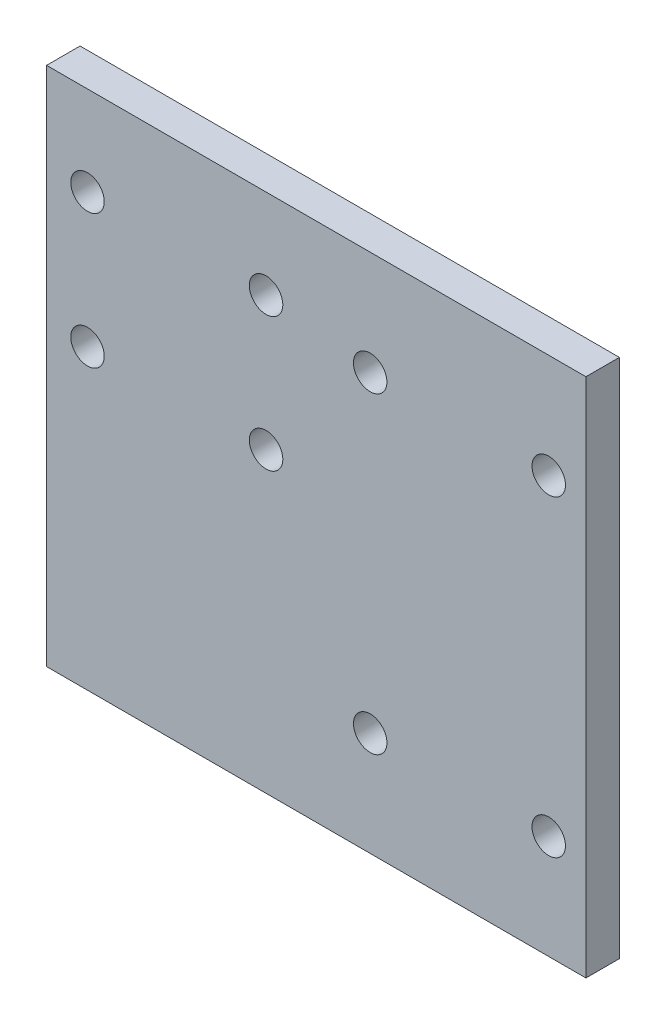
ISO-10303-21;
HEADER;
FILE_DESCRIPTION(('STEP AP214'),'2;1');
FILE_NAME('part.step','',(''),(''),'','','');
FILE_SCHEMA(('AUTOMOTIVE_DESIGN { 1 0 10303 214 1 1 1 1 }'));
ENDSEC;
DATA;
#1=APPLICATION_CONTEXT('core data for automotive mechanical design processes');
#2=APPLICATION_PROTOCOL_DEFINITION('international standard','automotive_design',2000,#1);
#3=PRODUCT_CONTEXT('',#1,'mechanical');
#4=PRODUCT('Part','Part','',(#3));
#5=PRODUCT_RELATED_PRODUCT_CATEGORY('part','',(#4));
#6=PRODUCT_DEFINITION_FORMATION('','',#4);
#7=PRODUCT_DEFINITION_CONTEXT('part definition',#1,'design');
#8=PRODUCT_DEFINITION('design','',#6,#7);
#9=PRODUCT_DEFINITION_SHAPE('','',#8);
#10=(LENGTH_UNIT() NAMED_UNIT(*) SI_UNIT(.MILLI.,.METRE.));
#11=(NAMED_UNIT(*) PLANE_ANGLE_UNIT() SI_UNIT($,.RADIAN.));
#12=(NAMED_UNIT(*) SI_UNIT($,.STERADIAN.) SOLID_ANGLE_UNIT());
#13=UNCERTAINTY_MEASURE_WITH_UNIT(LENGTH_MEASURE(1.E-05),#10,'distance_accuracy_value','');
#14=(GEOMETRIC_REPRESENTATION_CONTEXT(3) GLOBAL_UNCERTAINTY_ASSIGNED_CONTEXT((#13)) GLOBAL_UNIT_ASSIGNED_CONTEXT((#10,
#11,#12)) REPRESENTATION_CONTEXT('',''));
#15=CARTESIAN_POINT('',(0.,0.,0.));
#16=DIRECTION('',(0.,0.,1.));
#17=DIRECTION('',(1.,0.,0.));
#18=AXIS2_PLACEMENT_3D('',#15,#16,#17);
#19=CARTESIAN_POINT('',(-40.2261499577321,36.6168583740955,-4.5));
#20=DIRECTION('',(-1.,0.,0.));
#21=DIRECTION('',(0.,-1.,0.));
#22=AXIS2_PLACEMENT_3D('',#19,#20,#21);
#23=PLANE('',#22);
#24=DIRECTION('',(0.,-1.,0.));
#25=VECTOR('',#24,1.);
#26=CARTESIAN_POINT('',(-40.2261499577321,36.6168583740955,0.));
#27=LINE('',#26,#25);
#28=CARTESIAN_POINT('',(-40.2261499577321,36.6168583740955,0.));
#29=VERTEX_POINT('',#28);
#30=CARTESIAN_POINT('',(-40.2261499577321,-33.3831416259045,0.));
#31=VERTEX_POINT('',#30);
#32=EDGE_CURVE('E104',#29,#31,#27,.T.);
#33=ORIENTED_EDGE('',*,*,#32,.F.);
#34=DIRECTION('',(0.,0.,1.));
#35=VECTOR('',#34,1.);
#36=CARTESIAN_POINT('',(-40.2261499577321,36.6168583740955,-4.5));
#37=LINE('',#36,#35);
#38=CARTESIAN_POINT('',(-40.2261499577321,36.6168583740955,-4.5));
#39=VERTEX_POINT('',#38);
#40=EDGE_CURVE('E11',#39,#29,#37,.T.);
#41=ORIENTED_EDGE('',*,*,#40,.F.);
#42=DIRECTION('',(0.,-1.,0.));
#43=VECTOR('',#42,1.);
#44=CARTESIAN_POINT('',(-40.2261499577321,36.6168583740955,-4.5));
#45=LINE('',#44,#43);
#46=CARTESIAN_POINT('',(-40.2261499577321,-33.3831416259045,-4.5));
#47=VERTEX_POINT('',#46);
#48=EDGE_CURVE('E97',#39,#47,#45,.T.);
#49=ORIENTED_EDGE('',*,*,#48,.T.);
#50=DIRECTION('',(0.,0.,1.));
#51=VECTOR('',#50,1.);
#52=CARTESIAN_POINT('',(-40.2261499577321,-33.3831416259045,-4.5));
#53=LINE('',#52,#51);
#54=EDGE_CURVE('E42',#47,#31,#53,.T.);
#55=ORIENTED_EDGE('',*,*,#54,.T.);
#56=EDGE_LOOP('',(#33,#41,#49,#55));
#57=FACE_BOUND('',#56,.T.);
#58=ADVANCED_FACE('F39',(#57),#23,.T.);
#59=CARTESIAN_POINT('',(-40.2261499577321,36.6168583740955,-4.5));
#60=DIRECTION('',(0.,1.,0.));
#61=DIRECTION('',(0.,0.,1.));
#62=AXIS2_PLACEMENT_3D('',#59,#60,#61);
#63=PLANE('',#62);
#64=DIRECTION('',(-1.,0.,0.));
#65=VECTOR('',#64,1.);
#66=CARTESIAN_POINT('',(-40.2261499577321,36.6168583740955,0.));
#67=LINE('',#66,#65);
#68=CARTESIAN_POINT('',(32.2738500422679,36.6168583740955,0.));
#69=VERTEX_POINT('',#68);
#70=EDGE_CURVE('E99',#69,#29,#67,.T.);
#71=ORIENTED_EDGE('',*,*,#70,.F.);
#72=DIRECTION('',(0.,0.,1.));
#73=VECTOR('',#72,1.);
#74=CARTESIAN_POINT('',(32.2738500422679,36.6168583740955,-4.5));
#75=LINE('',#74,#73);
#76=CARTESIAN_POINT('',(32.2738500422679,36.6168583740955,-4.5));
#77=VERTEX_POINT('',#76);
#78=EDGE_CURVE('E48',#77,#69,#75,.T.);
#79=ORIENTED_EDGE('',*,*,#78,.F.);
#80=DIRECTION('',(-1.,0.,0.));
#81=VECTOR('',#80,1.);
#82=CARTESIAN_POINT('',(-40.2261499577321,36.6168583740955,-4.5));
#83=LINE('',#82,#81);
#84=EDGE_CURVE('E94',#77,#39,#83,.T.);
#85=ORIENTED_EDGE('',*,*,#84,.T.);
#86=ORIENTED_EDGE('',*,*,#40,.T.);
#87=EDGE_LOOP('',(#71,#79,#85,#86));
#88=FACE_BOUND('',#87,.T.);
#89=ADVANCED_FACE('F115',(#88),#63,.T.);
#90=CARTESIAN_POINT('',(32.2738500422679,36.6168583740955,-4.5));
#91=DIRECTION('',(1.,0.,0.));
#92=DIRECTION('',(0.,1.,0.));
#93=AXIS2_PLACEMENT_3D('',#90,#91,#92);
#94=PLANE('',#93);
#95=DIRECTION('',(0.,1.,0.));
#96=VECTOR('',#95,1.);
#97=CARTESIAN_POINT('',(32.2738500422679,36.6168583740955,0.));
#98=LINE('',#97,#96);
#99=CARTESIAN_POINT('',(32.2738500422679,-33.3831416259045,0.));
#100=VERTEX_POINT('',#99);
#101=EDGE_CURVE('E89',#100,#69,#98,.T.);
#102=ORIENTED_EDGE('',*,*,#101,.F.);
#103=DIRECTION('',(0.,0.,1.));
#104=VECTOR('',#103,1.);
#105=CARTESIAN_POINT('',(32.2738500422679,-33.3831416259045,-4.5));
#106=LINE('',#105,#104);
#107=CARTESIAN_POINT('',(32.2738500422679,-33.3831416259045,-4.5));
#108=VERTEX_POINT('',#107);
#109=EDGE_CURVE('E84',#108,#100,#106,.T.);
#110=ORIENTED_EDGE('',*,*,#109,.F.);
#111=DIRECTION('',(0.,1.,0.));
#112=VECTOR('',#111,1.);
#113=CARTESIAN_POINT('',(32.2738500422679,36.6168583740955,-4.5));
#114=LINE('',#113,#112);
#115=EDGE_CURVE('E87',#108,#77,#114,.T.);
#116=ORIENTED_EDGE('',*,*,#115,.T.);
#117=ORIENTED_EDGE('',*,*,#78,.T.);
#118=EDGE_LOOP('',(#102,#110,#116,#117));
#119=FACE_BOUND('',#118,.T.);
#120=ADVANCED_FACE('F86',(#119),#94,.T.);
#121=CARTESIAN_POINT('',(-40.2261499577321,-33.3831416259045,-4.5));
#122=DIRECTION('',(0.,-1.,0.));
#123=DIRECTION('',(0.,0.,-1.));
#124=AXIS2_PLACEMENT_3D('',#121,#122,#123);
#125=PLANE('',#124);
#126=DIRECTION('',(1.,0.,0.));
#127=VECTOR('',#126,1.);
#128=CARTESIAN_POINT('',(-40.2261499577321,-33.3831416259045,0.));
#129=LINE('',#128,#127);
#130=EDGE_CURVE('E107',#31,#100,#129,.T.);
#131=ORIENTED_EDGE('',*,*,#130,.F.);
#132=ORIENTED_EDGE('',*,*,#54,.F.);
#133=DIRECTION('',(1.,0.,0.));
#134=VECTOR('',#133,1.);
#135=CARTESIAN_POINT('',(-40.2261499577321,-33.3831416259045,-4.5));
#136=LINE('',#135,#134);
#137=EDGE_CURVE('E93',#47,#108,#136,.T.);
#138=ORIENTED_EDGE('',*,*,#137,.T.);
#139=ORIENTED_EDGE('',*,*,#109,.T.);
#140=EDGE_LOOP('',(#131,#132,#138,#139));
#141=FACE_BOUND('',#140,.T.);
#142=ADVANCED_FACE('F96',(#141),#125,.T.);
#143=CARTESIAN_POINT('',(0.,0.,-4.5));
#144=DIRECTION('',(0.,0.,1.));
#145=DIRECTION('',(1.,0.,0.));
#146=AXIS2_PLACEMENT_3D('',#143,#144,#145);
#147=PLANE('',#146);
#148=CARTESIAN_POINT('',(27.2738500422703,22.6168583741015,-4.5));
#149=DIRECTION('',(0.,0.,1.));
#150=DIRECTION('',(-1.,0.,0.));
#151=AXIS2_PLACEMENT_3D('',#148,#149,#150);
#152=CIRCLE('',#151,2.25000000000001);
#153=CARTESIAN_POINT('',(25.0238500422703,22.6168583741015,-4.5));
#154=VERTEX_POINT('',#153);
#155=EDGE_CURVE('E172',#154,#154,#152,.T.);
#156=ORIENTED_EDGE('',*,*,#155,.T.);
#157=EDGE_LOOP('',(#156));
#158=FACE_BOUND('',#157,.T.);
#159=CARTESIAN_POINT('',(27.2738500422705,-19.3831416258993,-4.5));
#160=DIRECTION('',(0.,0.,1.));
#161=DIRECTION('',(-1.,0.,0.));
#162=AXIS2_PLACEMENT_3D('',#159,#160,#161);
#163=CIRCLE('',#162,2.25000000000001);
#164=CARTESIAN_POINT('',(25.0238500422705,-19.3831416258993,-4.5));
#165=VERTEX_POINT('',#164);
#166=EDGE_CURVE('E180',#165,#165,#163,.T.);
#167=ORIENTED_EDGE('',*,*,#166,.T.);
#168=EDGE_LOOP('',(#167));
#169=FACE_BOUND('',#168,.T.);
#170=CARTESIAN_POINT('',(3.27385004226982,22.6168583741013,-4.5));
#171=DIRECTION('',(0.,0.,1.));
#172=DIRECTION('',(-1.,0.,0.));
#173=AXIS2_PLACEMENT_3D('',#170,#171,#172);
#174=CIRCLE('',#173,2.25000000000001);
#175=CARTESIAN_POINT('',(1.02385004226982,22.6168583741013,-4.5));
#176=VERTEX_POINT('',#175);
#177=EDGE_CURVE('E186',#176,#176,#174,.T.);
#178=ORIENTED_EDGE('',*,*,#177,.T.);
#179=EDGE_LOOP('',(#178));
#180=FACE_BOUND('',#179,.T.);
#181=CARTESIAN_POINT('',(3.27385004227005,-19.3831416258995,-4.5));
#182=DIRECTION('',(0.,0.,1.));
#183=DIRECTION('',(-1.,0.,0.));
#184=AXIS2_PLACEMENT_3D('',#181,#182,#183);
#185=CIRCLE('',#184,2.25000000000001);
#186=CARTESIAN_POINT('',(1.02385004227004,-19.3831416258995,-4.5));
#187=VERTEX_POINT('',#186);
#188=EDGE_CURVE('E192',#187,#187,#185,.T.);
#189=ORIENTED_EDGE('',*,*,#188,.T.);
#190=EDGE_LOOP('',(#189));
#191=FACE_BOUND('',#190,.T.);
#192=CARTESIAN_POINT('',(-34.7261499576124,6.61685837409152,-4.5));
#193=DIRECTION('',(0.,0.,1.));
#194=DIRECTION('',(-1.,0.,0.));
#195=AXIS2_PLACEMENT_3D('',#192,#193,#194);
#196=CIRCLE('',#195,2.25000000000001);
#197=CARTESIAN_POINT('',(-36.9761499576124,6.61685837409152,-4.5));
#198=VERTEX_POINT('',#197);
#199=EDGE_CURVE('E198',#198,#198,#196,.T.);
#200=ORIENTED_EDGE('',*,*,#199,.T.);
#201=EDGE_LOOP('',(#200));
#202=FACE_BOUND('',#201,.T.);
#203=CARTESIAN_POINT('',(-10.7261499576119,6.61685837409152,-4.5));
#204=DIRECTION('',(0.,0.,1.));
#205=DIRECTION('',(-1.,0.,0.));
#206=AXIS2_PLACEMENT_3D('',#203,#204,#205);
#207=CIRCLE('',#206,2.25000000000001);
#208=CARTESIAN_POINT('',(-12.9761499576119,6.61685837409152,-4.5));
#209=VERTEX_POINT('',#208);
#210=EDGE_CURVE('E204',#209,#209,#207,.T.);
#211=ORIENTED_EDGE('',*,*,#210,.T.);
#212=EDGE_LOOP('',(#211));
#213=FACE_BOUND('',#212,.T.);
#214=CARTESIAN_POINT('',(-10.7261499576262,24.6168583740919,-4.5));
#215=DIRECTION('',(0.,0.,1.));
#216=DIRECTION('',(-1.,0.,0.));
#217=AXIS2_PLACEMENT_3D('',#214,#215,#216);
#218=CIRCLE('',#217,2.25000000000001);
#219=CARTESIAN_POINT('',(-12.9761499576262,24.6168583740919,-4.5));
#220=VERTEX_POINT('',#219);
#221=EDGE_CURVE('E210',#220,#220,#218,.T.);
#222=ORIENTED_EDGE('',*,*,#221,.T.);
#223=EDGE_LOOP('',(#222));
#224=FACE_BOUND('',#223,.T.);
#225=CARTESIAN_POINT('',(-34.7261499576124,24.6168583740919,-4.5));
#226=DIRECTION('',(0.,0.,1.));
#227=DIRECTION('',(-1.,0.,0.));
#228=AXIS2_PLACEMENT_3D('',#225,#226,#227);
#229=CIRCLE('',#228,2.25000000000001);
#230=CARTESIAN_POINT('',(-36.9761499576124,24.6168583740919,-4.5));
#231=VERTEX_POINT('',#230);
#232=EDGE_CURVE('E108',#231,#231,#229,.T.);
#233=ORIENTED_EDGE('',*,*,#232,.T.);
#234=EDGE_LOOP('',(#233));
#235=FACE_BOUND('',#234,.T.);
#236=ORIENTED_EDGE('',*,*,#48,.F.);
#237=ORIENTED_EDGE('',*,*,#84,.F.);
#238=ORIENTED_EDGE('',*,*,#115,.F.);
#239=ORIENTED_EDGE('',*,*,#137,.F.);
#240=EDGE_LOOP('',(#236,#237,#238,#239));
#241=FACE_BOUND('',#240,.T.);
#242=ADVANCED_FACE('F92',(#158,#169,#180,#191,#202,#213,#224,#235,#241),#147,.F.);
#243=CARTESIAN_POINT('',(0.,0.,0.));
#244=DIRECTION('',(0.,0.,1.));
#245=DIRECTION('',(1.,0.,0.));
#246=AXIS2_PLACEMENT_3D('',#243,#244,#245);
#247=PLANE('',#246);
#248=CARTESIAN_POINT('',(27.2738500422703,22.6168583741015,0.));
#249=DIRECTION('',(0.,0.,1.));
#250=DIRECTION('',(-1.,0.,0.));
#251=AXIS2_PLACEMENT_3D('',#248,#249,#250);
#252=CIRCLE('',#251,2.25000000000001);
#253=CARTESIAN_POINT('',(25.0238500422703,22.6168583741015,0.));
#254=VERTEX_POINT('',#253);
#255=EDGE_CURVE('E175',#254,#254,#252,.T.);
#256=ORIENTED_EDGE('',*,*,#255,.F.);
#257=EDGE_LOOP('',(#256));
#258=FACE_BOUND('',#257,.T.);
#259=CARTESIAN_POINT('',(27.2738500422705,-19.3831416258993,0.));
#260=DIRECTION('',(0.,0.,1.));
#261=DIRECTION('',(-1.,0.,0.));
#262=AXIS2_PLACEMENT_3D('',#259,#260,#261);
#263=CIRCLE('',#262,2.25000000000001);
#264=CARTESIAN_POINT('',(25.0238500422705,-19.3831416258993,0.));
#265=VERTEX_POINT('',#264);
#266=EDGE_CURVE('E177',#265,#265,#263,.T.);
#267=ORIENTED_EDGE('',*,*,#266,.F.);
#268=EDGE_LOOP('',(#267));
#269=FACE_BOUND('',#268,.T.);
#270=CARTESIAN_POINT('',(3.27385004226982,22.6168583741013,0.));
#271=DIRECTION('',(0.,0.,1.));
#272=DIRECTION('',(-1.,0.,0.));
#273=AXIS2_PLACEMENT_3D('',#270,#271,#272);
#274=CIRCLE('',#273,2.25000000000001);
#275=CARTESIAN_POINT('',(1.02385004226982,22.6168583741013,0.));
#276=VERTEX_POINT('',#275);
#277=EDGE_CURVE('E183',#276,#276,#274,.T.);
#278=ORIENTED_EDGE('',*,*,#277,.F.);
#279=EDGE_LOOP('',(#278));
#280=FACE_BOUND('',#279,.T.);
#281=CARTESIAN_POINT('',(3.27385004227005,-19.3831416258995,0.));
#282=DIRECTION('',(0.,0.,1.));
#283=DIRECTION('',(-1.,0.,0.));
#284=AXIS2_PLACEMENT_3D('',#281,#282,#283);
#285=CIRCLE('',#284,2.25000000000001);
#286=CARTESIAN_POINT('',(1.02385004227004,-19.3831416258995,0.));
#287=VERTEX_POINT('',#286);
#288=EDGE_CURVE('E189',#287,#287,#285,.T.);
#289=ORIENTED_EDGE('',*,*,#288,.F.);
#290=EDGE_LOOP('',(#289));
#291=FACE_BOUND('',#290,.T.);
#292=CARTESIAN_POINT('',(-34.7261499576124,6.61685837409152,0.));
#293=DIRECTION('',(0.,0.,1.));
#294=DIRECTION('',(-1.,0.,0.));
#295=AXIS2_PLACEMENT_3D('',#292,#293,#294);
#296=CIRCLE('',#295,2.25000000000001);
#297=CARTESIAN_POINT('',(-36.9761499576124,6.61685837409152,0.));
#298=VERTEX_POINT('',#297);
#299=EDGE_CURVE('E195',#298,#298,#296,.T.);
#300=ORIENTED_EDGE('',*,*,#299,.F.);
#301=EDGE_LOOP('',(#300));
#302=FACE_BOUND('',#301,.T.);
#303=CARTESIAN_POINT('',(-10.7261499576119,6.61685837409152,0.));
#304=DIRECTION('',(0.,0.,1.));
#305=DIRECTION('',(-1.,0.,0.));
#306=AXIS2_PLACEMENT_3D('',#303,#304,#305);
#307=CIRCLE('',#306,2.25000000000001);
#308=CARTESIAN_POINT('',(-12.9761499576119,6.61685837409152,0.));
#309=VERTEX_POINT('',#308);
#310=EDGE_CURVE('E201',#309,#309,#307,.T.);
#311=ORIENTED_EDGE('',*,*,#310,.F.);
#312=EDGE_LOOP('',(#311));
#313=FACE_BOUND('',#312,.T.);
#314=CARTESIAN_POINT('',(-10.7261499576262,24.6168583740919,0.));
#315=DIRECTION('',(0.,0.,1.));
#316=DIRECTION('',(-1.,0.,0.));
#317=AXIS2_PLACEMENT_3D('',#314,#315,#316);
#318=CIRCLE('',#317,2.25000000000001);
#319=CARTESIAN_POINT('',(-12.9761499576262,24.6168583740919,0.));
#320=VERTEX_POINT('',#319);
#321=EDGE_CURVE('E207',#320,#320,#318,.T.);
#322=ORIENTED_EDGE('',*,*,#321,.F.);
#323=EDGE_LOOP('',(#322));
#324=FACE_BOUND('',#323,.T.);
#325=CARTESIAN_POINT('',(-34.7261499576124,24.6168583740919,0.));
#326=DIRECTION('',(0.,0.,1.));
#327=DIRECTION('',(-1.,0.,0.));
#328=AXIS2_PLACEMENT_3D('',#325,#326,#327);
#329=CIRCLE('',#328,2.25000000000001);
#330=CARTESIAN_POINT('',(-36.9761499576124,24.6168583740919,0.));
#331=VERTEX_POINT('',#330);
#332=EDGE_CURVE('E213',#331,#331,#329,.T.);
#333=ORIENTED_EDGE('',*,*,#332,.F.);
#334=EDGE_LOOP('',(#333));
#335=FACE_BOUND('',#334,.T.);
#336=ORIENTED_EDGE('',*,*,#32,.T.);
#337=ORIENTED_EDGE('',*,*,#130,.T.);
#338=ORIENTED_EDGE('',*,*,#101,.T.);
#339=ORIENTED_EDGE('',*,*,#70,.T.);
#340=EDGE_LOOP('',(#336,#337,#338,#339));
#341=FACE_BOUND('',#340,.T.);
#342=ADVANCED_FACE('F114',(#258,#269,#280,#291,#302,#313,#324,#335,#341),#247,.T.);
#343=CARTESIAN_POINT('',(-34.7261499576124,24.6168583740919,-4.5));
#344=DIRECTION('',(0.,0.,1.));
#345=DIRECTION('',(1.,0.,0.));
#346=AXIS2_PLACEMENT_3D('',#343,#344,#345);
#347=CYLINDRICAL_SURFACE('',#346,2.25000000000001);
#348=ORIENTED_EDGE('',*,*,#232,.F.);
#349=EDGE_LOOP('',(#348));
#350=FACE_BOUND('',#349,.T.);
#351=ORIENTED_EDGE('',*,*,#332,.T.);
#352=EDGE_LOOP('',(#351));
#353=FACE_BOUND('',#352,.T.);
#354=ADVANCED_FACE('F133',(#350,#353),#347,.F.);
#355=CARTESIAN_POINT('',(-10.7261499576262,24.6168583740919,-4.5));
#356=DIRECTION('',(0.,0.,1.));
#357=DIRECTION('',(1.,0.,0.));
#358=AXIS2_PLACEMENT_3D('',#355,#356,#357);
#359=CYLINDRICAL_SURFACE('',#358,2.25000000000001);
#360=ORIENTED_EDGE('',*,*,#221,.F.);
#361=EDGE_LOOP('',(#360));
#362=FACE_BOUND('',#361,.T.);
#363=ORIENTED_EDGE('',*,*,#321,.T.);
#364=EDGE_LOOP('',(#363));
#365=FACE_BOUND('',#364,.T.);
#366=ADVANCED_FACE('F140',(#362,#365),#359,.F.);
#367=CARTESIAN_POINT('',(-10.7261499576119,6.61685837409152,-4.5));
#368=DIRECTION('',(0.,0.,1.));
#369=DIRECTION('',(1.,0.,0.));
#370=AXIS2_PLACEMENT_3D('',#367,#368,#369);
#371=CYLINDRICAL_SURFACE('',#370,2.25000000000001);
#372=ORIENTED_EDGE('',*,*,#210,.F.);
#373=EDGE_LOOP('',(#372));
#374=FACE_BOUND('',#373,.T.);
#375=ORIENTED_EDGE('',*,*,#310,.T.);
#376=EDGE_LOOP('',(#375));
#377=FACE_BOUND('',#376,.T.);
#378=ADVANCED_FACE('F144',(#374,#377),#371,.F.);
#379=CARTESIAN_POINT('',(-34.7261499576124,6.61685837409152,-4.5));
#380=DIRECTION('',(0.,0.,1.));
#381=DIRECTION('',(1.,0.,0.));
#382=AXIS2_PLACEMENT_3D('',#379,#380,#381);
#383=CYLINDRICAL_SURFACE('',#382,2.25000000000001);
#384=ORIENTED_EDGE('',*,*,#199,.F.);
#385=EDGE_LOOP('',(#384));
#386=FACE_BOUND('',#385,.T.);
#387=ORIENTED_EDGE('',*,*,#299,.T.);
#388=EDGE_LOOP('',(#387));
#389=FACE_BOUND('',#388,.T.);
#390=ADVANCED_FACE('F148',(#386,#389),#383,.F.);
#391=CARTESIAN_POINT('',(3.27385004227005,-19.3831416258995,-4.5));
#392=DIRECTION('',(0.,0.,1.));
#393=DIRECTION('',(1.,0.,0.));
#394=AXIS2_PLACEMENT_3D('',#391,#392,#393);
#395=CYLINDRICAL_SURFACE('',#394,2.25000000000001);
#396=ORIENTED_EDGE('',*,*,#188,.F.);
#397=EDGE_LOOP('',(#396));
#398=FACE_BOUND('',#397,.T.);
#399=ORIENTED_EDGE('',*,*,#288,.T.);
#400=EDGE_LOOP('',(#399));
#401=FACE_BOUND('',#400,.T.);
#402=ADVANCED_FACE('F152',(#398,#401),#395,.F.);
#403=CARTESIAN_POINT('',(3.27385004226982,22.6168583741013,-4.5));
#404=DIRECTION('',(0.,0.,1.));
#405=DIRECTION('',(1.,0.,0.));
#406=AXIS2_PLACEMENT_3D('',#403,#404,#405);
#407=CYLINDRICAL_SURFACE('',#406,2.25000000000001);
#408=ORIENTED_EDGE('',*,*,#177,.F.);
#409=EDGE_LOOP('',(#408));
#410=FACE_BOUND('',#409,.T.);
#411=ORIENTED_EDGE('',*,*,#277,.T.);
#412=EDGE_LOOP('',(#411));
#413=FACE_BOUND('',#412,.T.);
#414=ADVANCED_FACE('F156',(#410,#413),#407,.F.);
#415=CARTESIAN_POINT('',(27.2738500422705,-19.3831416258993,-4.5));
#416=DIRECTION('',(0.,0.,1.));
#417=DIRECTION('',(1.,0.,0.));
#418=AXIS2_PLACEMENT_3D('',#415,#416,#417);
#419=CYLINDRICAL_SURFACE('',#418,2.25000000000001);
#420=ORIENTED_EDGE('',*,*,#166,.F.);
#421=EDGE_LOOP('',(#420));
#422=FACE_BOUND('',#421,.T.);
#423=ORIENTED_EDGE('',*,*,#266,.T.);
#424=EDGE_LOOP('',(#423));
#425=FACE_BOUND('',#424,.T.);
#426=ADVANCED_FACE('F160',(#422,#425),#419,.F.);
#427=CARTESIAN_POINT('',(27.2738500422703,22.6168583741015,-4.5));
#428=DIRECTION('',(0.,0.,1.));
#429=DIRECTION('',(1.,0.,0.));
#430=AXIS2_PLACEMENT_3D('',#427,#428,#429);
#431=CYLINDRICAL_SURFACE('',#430,2.25000000000001);
#432=ORIENTED_EDGE('',*,*,#155,.F.);
#433=EDGE_LOOP('',(#432));
#434=FACE_BOUND('',#433,.T.);
#435=ORIENTED_EDGE('',*,*,#255,.T.);
#436=EDGE_LOOP('',(#435));
#437=FACE_BOUND('',#436,.T.);
#438=ADVANCED_FACE('F164',(#434,#437),#431,.F.);
#439=CLOSED_SHELL('',(#58,#89,#120,#142,#242,#342,#354,#366,#378,#390,#402,#414,#426,#438));
#440=MANIFOLD_SOLID_BREP('B2',#439);
#441=ADVANCED_BREP_SHAPE_REPRESENTATION('',(#18,#440),#14);
#442=SHAPE_DEFINITION_REPRESENTATION(#9,#441);
ENDSEC;
END-ISO-10303-21;
